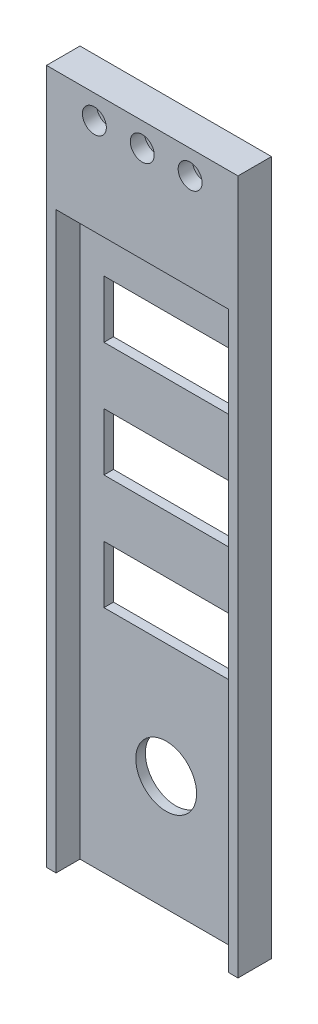
ISO-10303-21;
HEADER;
FILE_DESCRIPTION(('STEP AP214'),'2;1');
FILE_NAME('part.step','',(''),(''),'','','');
FILE_SCHEMA(('AUTOMOTIVE_DESIGN { 1 0 10303 214 1 1 1 1 }'));
ENDSEC;
DATA;
#1=APPLICATION_CONTEXT('core data for automotive mechanical design processes');
#2=APPLICATION_PROTOCOL_DEFINITION('international standard','automotive_design',2000,#1);
#3=PRODUCT_CONTEXT('',#1,'mechanical');
#4=PRODUCT('Part','Part','',(#3));
#5=PRODUCT_RELATED_PRODUCT_CATEGORY('part','',(#4));
#6=PRODUCT_DEFINITION_FORMATION('','',#4);
#7=PRODUCT_DEFINITION_CONTEXT('part definition',#1,'design');
#8=PRODUCT_DEFINITION('design','',#6,#7);
#9=PRODUCT_DEFINITION_SHAPE('','',#8);
#10=(LENGTH_UNIT() NAMED_UNIT(*) SI_UNIT(.MILLI.,.METRE.));
#11=(NAMED_UNIT(*) PLANE_ANGLE_UNIT() SI_UNIT($,.RADIAN.));
#12=(NAMED_UNIT(*) SI_UNIT($,.STERADIAN.) SOLID_ANGLE_UNIT());
#13=UNCERTAINTY_MEASURE_WITH_UNIT(LENGTH_MEASURE(1.E-05),#10,'distance_accuracy_value','');
#14=(GEOMETRIC_REPRESENTATION_CONTEXT(3) GLOBAL_UNCERTAINTY_ASSIGNED_CONTEXT((#13)) GLOBAL_UNIT_ASSIGNED_CONTEXT((#10,
#11,#12)) REPRESENTATION_CONTEXT('',''));
#15=CARTESIAN_POINT('',(0.,0.,0.));
#16=DIRECTION('',(0.,0.,1.));
#17=DIRECTION('',(1.,0.,0.));
#18=AXIS2_PLACEMENT_3D('',#15,#16,#17);
#19=CARTESIAN_POINT('',(20.,140.1,0.));
#20=DIRECTION('',(0.,0.,1.));
#21=DIRECTION('',(1.,0.,0.));
#22=AXIS2_PLACEMENT_3D('',#19,#20,#21);
#23=CYLINDRICAL_SURFACE('',#22,1.25);
#24=CARTESIAN_POINT('',(20.,140.1,0.));
#25=DIRECTION('',(0.,0.,1.));
#26=DIRECTION('',(1.,0.,0.));
#27=AXIS2_PLACEMENT_3D('',#24,#25,#26);
#28=CIRCLE('',#27,1.25);
#29=CARTESIAN_POINT('',(21.25,140.1,0.));
#30=VERTEX_POINT('',#29);
#31=EDGE_CURVE('E329',#30,#30,#28,.T.);
#32=ORIENTED_EDGE('',*,*,#31,.F.);
#33=EDGE_LOOP('',(#32));
#34=FACE_BOUND('',#33,.T.);
#35=CARTESIAN_POINT('',(20.,140.1,4.));
#36=DIRECTION('',(0.,0.,1.));
#37=DIRECTION('',(1.,0.,0.));
#38=AXIS2_PLACEMENT_3D('',#35,#36,#37);
#39=CIRCLE('',#38,1.25);
#40=CARTESIAN_POINT('',(21.25,140.1,4.));
#41=VERTEX_POINT('',#40);
#42=EDGE_CURVE('E333',#41,#41,#39,.F.);
#43=ORIENTED_EDGE('',*,*,#42,.F.);
#44=EDGE_LOOP('',(#43));
#45=FACE_BOUND('',#44,.T.);
#46=ADVANCED_FACE('F34',(#34,#45),#23,.F.);
#47=CARTESIAN_POINT('',(10.,140.1,0.));
#48=DIRECTION('',(0.,0.,1.));
#49=DIRECTION('',(1.,0.,0.));
#50=AXIS2_PLACEMENT_3D('',#47,#48,#49);
#51=CYLINDRICAL_SURFACE('',#50,1.25);
#52=CARTESIAN_POINT('',(10.,140.1,0.));
#53=DIRECTION('',(0.,0.,1.));
#54=DIRECTION('',(1.,0.,0.));
#55=AXIS2_PLACEMENT_3D('',#52,#53,#54);
#56=CIRCLE('',#55,1.25);
#57=CARTESIAN_POINT('',(11.25,140.1,0.));
#58=VERTEX_POINT('',#57);
#59=EDGE_CURVE('E326',#58,#58,#56,.T.);
#60=ORIENTED_EDGE('',*,*,#59,.F.);
#61=EDGE_LOOP('',(#60));
#62=FACE_BOUND('',#61,.T.);
#63=CARTESIAN_POINT('',(10.,140.1,4.));
#64=DIRECTION('',(0.,0.,1.));
#65=DIRECTION('',(1.,0.,0.));
#66=AXIS2_PLACEMENT_3D('',#63,#64,#65);
#67=CIRCLE('',#66,1.25);
#68=CARTESIAN_POINT('',(11.25,140.1,4.));
#69=VERTEX_POINT('',#68);
#70=EDGE_CURVE('E367',#69,#69,#67,.F.);
#71=ORIENTED_EDGE('',*,*,#70,.F.);
#72=EDGE_LOOP('',(#71));
#73=FACE_BOUND('',#72,.T.);
#74=ADVANCED_FACE('F375',(#62,#73),#51,.F.);
#75=CARTESIAN_POINT('',(30.,140.1,0.));
#76=DIRECTION('',(0.,0.,1.));
#77=DIRECTION('',(1.,0.,0.));
#78=AXIS2_PLACEMENT_3D('',#75,#76,#77);
#79=CYLINDRICAL_SURFACE('',#78,1.25);
#80=CARTESIAN_POINT('',(30.,140.1,0.));
#81=DIRECTION('',(0.,0.,1.));
#82=DIRECTION('',(1.,0.,0.));
#83=AXIS2_PLACEMENT_3D('',#80,#81,#82);
#84=CIRCLE('',#83,1.25);
#85=CARTESIAN_POINT('',(31.25,140.1,0.));
#86=VERTEX_POINT('',#85);
#87=EDGE_CURVE('E330',#86,#86,#84,.T.);
#88=ORIENTED_EDGE('',*,*,#87,.F.);
#89=EDGE_LOOP('',(#88));
#90=FACE_BOUND('',#89,.T.);
#91=CARTESIAN_POINT('',(30.,140.1,4.));
#92=DIRECTION('',(0.,0.,1.));
#93=DIRECTION('',(1.,0.,0.));
#94=AXIS2_PLACEMENT_3D('',#91,#92,#93);
#95=CIRCLE('',#94,1.25);
#96=CARTESIAN_POINT('',(31.25,140.1,4.));
#97=VERTEX_POINT('',#96);
#98=EDGE_CURVE('E311',#97,#97,#95,.F.);
#99=ORIENTED_EDGE('',*,*,#98,.F.);
#100=EDGE_LOOP('',(#99));
#101=FACE_BOUND('',#100,.T.);
#102=ADVANCED_FACE('F381',(#90,#101),#79,.F.);
#103=CARTESIAN_POINT('',(0.,0.,7.));
#104=DIRECTION('',(0.,1.,0.));
#105=DIRECTION('',(0.,0.,1.));
#106=AXIS2_PLACEMENT_3D('',#103,#104,#105);
#107=PLANE('',#106);
#108=DIRECTION('',(1.,0.,0.));
#109=VECTOR('',#108,1.);
#110=CARTESIAN_POINT('',(2.,0.,2.));
#111=LINE('',#110,#109);
#112=CARTESIAN_POINT('',(2.,0.,2.));
#113=VERTEX_POINT('',#112);
#114=CARTESIAN_POINT('',(38.,0.,2.));
#115=VERTEX_POINT('',#114);
#116=EDGE_CURVE('E279',#113,#115,#111,.T.);
#117=ORIENTED_EDGE('',*,*,#116,.F.);
#118=DIRECTION('',(0.,0.,1.));
#119=VECTOR('',#118,1.);
#120=CARTESIAN_POINT('',(2.,0.,2.));
#121=LINE('',#120,#119);
#122=CARTESIAN_POINT('',(2.,0.,7.));
#123=VERTEX_POINT('',#122);
#124=EDGE_CURVE('E289',#113,#123,#121,.T.);
#125=ORIENTED_EDGE('',*,*,#124,.T.);
#126=DIRECTION('',(1.,0.,0.));
#127=VECTOR('',#126,1.);
#128=CARTESIAN_POINT('',(0.,0.,7.));
#129=LINE('',#128,#127);
#130=CARTESIAN_POINT('',(0.,0.,7.));
#131=VERTEX_POINT('',#130);
#132=EDGE_CURVE('E337',#131,#123,#129,.T.);
#133=ORIENTED_EDGE('',*,*,#132,.F.);
#134=DIRECTION('',(0.,0.,-1.));
#135=VECTOR('',#134,1.);
#136=CARTESIAN_POINT('',(0.,0.,7.));
#137=LINE('',#136,#135);
#138=CARTESIAN_POINT('',(0.,0.,0.));
#139=VERTEX_POINT('',#138);
#140=EDGE_CURVE('E349',#131,#139,#137,.T.);
#141=ORIENTED_EDGE('',*,*,#140,.T.);
#142=DIRECTION('',(1.,0.,0.));
#143=VECTOR('',#142,1.);
#144=CARTESIAN_POINT('',(0.,0.,0.));
#145=LINE('',#144,#143);
#146=CARTESIAN_POINT('',(40.,0.,0.));
#147=VERTEX_POINT('',#146);
#148=EDGE_CURVE('E336',#139,#147,#145,.T.);
#149=ORIENTED_EDGE('',*,*,#148,.T.);
#150=DIRECTION('',(0.,0.,-1.));
#151=VECTOR('',#150,1.);
#152=CARTESIAN_POINT('',(40.,0.,7.));
#153=LINE('',#152,#151);
#154=CARTESIAN_POINT('',(40.,0.,7.));
#155=VERTEX_POINT('',#154);
#156=EDGE_CURVE('E11',#155,#147,#153,.T.);
#157=ORIENTED_EDGE('',*,*,#156,.F.);
#158=CARTESIAN_POINT('',(38.,0.,7.));
#159=VERTEX_POINT('',#158);
#160=EDGE_CURVE('E341',#159,#155,#129,.T.);
#161=ORIENTED_EDGE('',*,*,#160,.F.);
#162=DIRECTION('',(0.,0.,1.));
#163=VECTOR('',#162,1.);
#164=CARTESIAN_POINT('',(38.,0.,2.));
#165=LINE('',#164,#163);
#166=EDGE_CURVE('E300',#115,#159,#165,.T.);
#167=ORIENTED_EDGE('',*,*,#166,.F.);
#168=EDGE_LOOP('',(#117,#125,#133,#141,#149,#157,#161,#167));
#169=FACE_BOUND('',#168,.T.);
#170=ADVANCED_FACE('F36',(#169),#107,.F.);
#171=CARTESIAN_POINT('',(40.,0.,7.));
#172=DIRECTION('',(-1.,0.,0.));
#173=DIRECTION('',(0.,0.,1.));
#174=AXIS2_PLACEMENT_3D('',#171,#172,#173);
#175=PLANE('',#174);
#176=DIRECTION('',(0.,1.,0.));
#177=VECTOR('',#176,1.);
#178=CARTESIAN_POINT('',(40.,0.,0.));
#179=LINE('',#178,#177);
#180=CARTESIAN_POINT('',(40.,145.1,0.));
#181=VERTEX_POINT('',#180);
#182=EDGE_CURVE('E352',#147,#181,#179,.T.);
#183=ORIENTED_EDGE('',*,*,#182,.T.);
#184=DIRECTION('',(0.,0.,-1.));
#185=VECTOR('',#184,1.);
#186=CARTESIAN_POINT('',(40.,145.1,7.));
#187=LINE('',#186,#185);
#188=CARTESIAN_POINT('',(40.,145.1,7.));
#189=VERTEX_POINT('',#188);
#190=EDGE_CURVE('E43',#189,#181,#187,.T.);
#191=ORIENTED_EDGE('',*,*,#190,.F.);
#192=DIRECTION('',(0.,1.,0.));
#193=VECTOR('',#192,1.);
#194=CARTESIAN_POINT('',(40.,0.,7.));
#195=LINE('',#194,#193);
#196=EDGE_CURVE('E340',#155,#189,#195,.T.);
#197=ORIENTED_EDGE('',*,*,#196,.F.);
#198=ORIENTED_EDGE('',*,*,#156,.T.);
#199=EDGE_LOOP('',(#183,#191,#197,#198));
#200=FACE_BOUND('',#199,.T.);
#201=ADVANCED_FACE('F400',(#200),#175,.F.);
#202=CARTESIAN_POINT('',(0.,145.1,7.));
#203=DIRECTION('',(0.,1.,0.));
#204=DIRECTION('',(0.,0.,1.));
#205=AXIS2_PLACEMENT_3D('',#202,#203,#204);
#206=PLANE('',#205);
#207=DIRECTION('',(1.,0.,0.));
#208=VECTOR('',#207,1.);
#209=CARTESIAN_POINT('',(0.,145.1,0.));
#210=LINE('',#209,#208);
#211=CARTESIAN_POINT('',(0.,145.1,0.));
#212=VERTEX_POINT('',#211);
#213=EDGE_CURVE('E355',#212,#181,#210,.T.);
#214=ORIENTED_EDGE('',*,*,#213,.F.);
#215=DIRECTION('',(0.,0.,-1.));
#216=VECTOR('',#215,1.);
#217=CARTESIAN_POINT('',(0.,145.1,7.));
#218=LINE('',#217,#216);
#219=CARTESIAN_POINT('',(0.,145.1,7.));
#220=VERTEX_POINT('',#219);
#221=EDGE_CURVE('E362',#220,#212,#218,.T.);
#222=ORIENTED_EDGE('',*,*,#221,.F.);
#223=DIRECTION('',(1.,0.,0.));
#224=VECTOR('',#223,1.);
#225=CARTESIAN_POINT('',(0.,145.1,7.));
#226=LINE('',#225,#224);
#227=EDGE_CURVE('E343',#220,#189,#226,.T.);
#228=ORIENTED_EDGE('',*,*,#227,.T.);
#229=ORIENTED_EDGE('',*,*,#190,.T.);
#230=EDGE_LOOP('',(#214,#222,#228,#229));
#231=FACE_BOUND('',#230,.T.);
#232=ADVANCED_FACE('F397',(#231),#206,.T.);
#233=CARTESIAN_POINT('',(0.,0.,7.));
#234=DIRECTION('',(-1.,0.,0.));
#235=DIRECTION('',(0.,0.,1.));
#236=AXIS2_PLACEMENT_3D('',#233,#234,#235);
#237=PLANE('',#236);
#238=DIRECTION('',(0.,1.,0.));
#239=VECTOR('',#238,1.);
#240=CARTESIAN_POINT('',(0.,0.,0.));
#241=LINE('',#240,#239);
#242=EDGE_CURVE('E358',#139,#212,#241,.T.);
#243=ORIENTED_EDGE('',*,*,#242,.F.);
#244=ORIENTED_EDGE('',*,*,#140,.F.);
#245=DIRECTION('',(0.,1.,0.));
#246=VECTOR('',#245,1.);
#247=CARTESIAN_POINT('',(0.,0.,7.));
#248=LINE('',#247,#246);
#249=EDGE_CURVE('E346',#131,#220,#248,.T.);
#250=ORIENTED_EDGE('',*,*,#249,.T.);
#251=ORIENTED_EDGE('',*,*,#221,.T.);
#252=EDGE_LOOP('',(#243,#244,#250,#251));
#253=FACE_BOUND('',#252,.T.);
#254=ADVANCED_FACE('F390',(#253),#237,.T.);
#255=CARTESIAN_POINT('',(0.,0.,7.));
#256=DIRECTION('',(0.,0.,1.));
#257=DIRECTION('',(1.,0.,0.));
#258=AXIS2_PLACEMENT_3D('',#255,#256,#257);
#259=PLANE('',#258);
#260=DIRECTION('',(0.,-1.,0.));
#261=VECTOR('',#260,1.);
#262=CARTESIAN_POINT('',(2.,0.,7.));
#263=LINE('',#262,#261);
#264=CARTESIAN_POINT('',(2.,120.,7.));
#265=VERTEX_POINT('',#264);
#266=EDGE_CURVE('E211',#265,#123,#263,.T.);
#267=ORIENTED_EDGE('',*,*,#266,.F.);
#268=DIRECTION('',(-1.,0.,0.));
#269=VECTOR('',#268,1.);
#270=CARTESIAN_POINT('',(2.,120.,7.));
#271=LINE('',#270,#269);
#272=CARTESIAN_POINT('',(38.,120.,7.));
#273=VERTEX_POINT('',#272);
#274=EDGE_CURVE('E280',#273,#265,#271,.T.);
#275=ORIENTED_EDGE('',*,*,#274,.F.);
#276=DIRECTION('',(0.,1.,0.));
#277=VECTOR('',#276,1.);
#278=CARTESIAN_POINT('',(38.,0.,7.));
#279=LINE('',#278,#277);
#280=EDGE_CURVE('E291',#159,#273,#279,.T.);
#281=ORIENTED_EDGE('',*,*,#280,.F.);
#282=ORIENTED_EDGE('',*,*,#160,.T.);
#283=ORIENTED_EDGE('',*,*,#196,.T.);
#284=ORIENTED_EDGE('',*,*,#227,.F.);
#285=ORIENTED_EDGE('',*,*,#249,.F.);
#286=ORIENTED_EDGE('',*,*,#132,.T.);
#287=EDGE_LOOP('',(#267,#275,#281,#282,#283,#284,#285,#286));
#288=FACE_BOUND('',#287,.T.);
#289=CARTESIAN_POINT('',(10.,140.1,7.));
#290=DIRECTION('',(0.,0.,1.));
#291=DIRECTION('',(1.,0.,0.));
#292=AXIS2_PLACEMENT_3D('',#289,#290,#291);
#293=CIRCLE('',#292,2.5);
#294=CARTESIAN_POINT('',(12.5,140.1,7.));
#295=VERTEX_POINT('',#294);
#296=EDGE_CURVE('E312',#295,#295,#293,.T.);
#297=ORIENTED_EDGE('',*,*,#296,.F.);
#298=EDGE_LOOP('',(#297));
#299=FACE_BOUND('',#298,.T.);
#300=CARTESIAN_POINT('',(20.,140.1,7.));
#301=DIRECTION('',(0.,0.,1.));
#302=DIRECTION('',(1.,0.,0.));
#303=AXIS2_PLACEMENT_3D('',#300,#301,#302);
#304=CIRCLE('',#303,2.5);
#305=CARTESIAN_POINT('',(22.5,140.1,7.));
#306=VERTEX_POINT('',#305);
#307=EDGE_CURVE('E318',#306,#306,#304,.T.);
#308=ORIENTED_EDGE('',*,*,#307,.F.);
#309=EDGE_LOOP('',(#308));
#310=FACE_BOUND('',#309,.T.);
#311=CARTESIAN_POINT('',(30.,140.1,7.));
#312=DIRECTION('',(0.,0.,1.));
#313=DIRECTION('',(1.,0.,0.));
#314=AXIS2_PLACEMENT_3D('',#311,#312,#313);
#315=CIRCLE('',#314,2.5);
#316=CARTESIAN_POINT('',(32.5,140.1,7.));
#317=VERTEX_POINT('',#316);
#318=EDGE_CURVE('E307',#317,#317,#315,.T.);
#319=ORIENTED_EDGE('',*,*,#318,.F.);
#320=EDGE_LOOP('',(#319));
#321=FACE_BOUND('',#320,.T.);
#322=ADVANCED_FACE('F387',(#288,#299,#310,#321),#259,.T.);
#323=CARTESIAN_POINT('',(0.,0.,0.));
#324=DIRECTION('',(0.,0.,1.));
#325=DIRECTION('',(1.,0.,0.));
#326=AXIS2_PLACEMENT_3D('',#323,#324,#325);
#327=PLANE('',#326);
#328=DIRECTION('',(-1.,0.,0.));
#329=VECTOR('',#328,1.);
#330=CARTESIAN_POINT('',(7.,108.,0.));
#331=LINE('',#330,#329);
#332=CARTESIAN_POINT('',(33.,108.,0.));
#333=VERTEX_POINT('',#332);
#334=CARTESIAN_POINT('',(7.,108.,0.));
#335=VERTEX_POINT('',#334);
#336=EDGE_CURVE('E185',#333,#335,#331,.T.);
#337=ORIENTED_EDGE('',*,*,#336,.T.);
#338=DIRECTION('',(0.,-1.,0.));
#339=VECTOR('',#338,1.);
#340=CARTESIAN_POINT('',(7.,108.,0.));
#341=LINE('',#340,#339);
#342=CARTESIAN_POINT('',(7.,96.,0.));
#343=VERTEX_POINT('',#342);
#344=EDGE_CURVE('E177',#335,#343,#341,.T.);
#345=ORIENTED_EDGE('',*,*,#344,.T.);
#346=DIRECTION('',(1.,0.,0.));
#347=VECTOR('',#346,1.);
#348=CARTESIAN_POINT('',(7.,96.,0.));
#349=LINE('',#348,#347);
#350=CARTESIAN_POINT('',(33.,96.,0.));
#351=VERTEX_POINT('',#350);
#352=EDGE_CURVE('E188',#343,#351,#349,.T.);
#353=ORIENTED_EDGE('',*,*,#352,.T.);
#354=DIRECTION('',(0.,1.,0.));
#355=VECTOR('',#354,1.);
#356=CARTESIAN_POINT('',(33.,108.,0.));
#357=LINE('',#356,#355);
#358=EDGE_CURVE('E51',#351,#333,#357,.T.);
#359=ORIENTED_EDGE('',*,*,#358,.T.);
#360=EDGE_LOOP('',(#337,#345,#353,#359));
#361=FACE_BOUND('',#360,.T.);
#362=DIRECTION('',(-1.,0.,0.));
#363=VECTOR('',#362,1.);
#364=CARTESIAN_POINT('',(7.,84.,0.));
#365=LINE('',#364,#363);
#366=CARTESIAN_POINT('',(33.,84.,0.));
#367=VERTEX_POINT('',#366);
#368=CARTESIAN_POINT('',(7.,84.,0.));
#369=VERTEX_POINT('',#368);
#370=EDGE_CURVE('E223',#367,#369,#365,.T.);
#371=ORIENTED_EDGE('',*,*,#370,.T.);
#372=DIRECTION('',(0.,-1.,0.));
#373=VECTOR('',#372,1.);
#374=CARTESIAN_POINT('',(7.,84.,0.));
#375=LINE('',#374,#373);
#376=CARTESIAN_POINT('',(7.,72.,0.));
#377=VERTEX_POINT('',#376);
#378=EDGE_CURVE('E215',#369,#377,#375,.T.);
#379=ORIENTED_EDGE('',*,*,#378,.T.);
#380=DIRECTION('',(1.,0.,0.));
#381=VECTOR('',#380,1.);
#382=CARTESIAN_POINT('',(7.,72.,0.));
#383=LINE('',#382,#381);
#384=CARTESIAN_POINT('',(33.,72.,0.));
#385=VERTEX_POINT('',#384);
#386=EDGE_CURVE('E218',#377,#385,#383,.T.);
#387=ORIENTED_EDGE('',*,*,#386,.T.);
#388=DIRECTION('',(0.,1.,0.));
#389=VECTOR('',#388,1.);
#390=CARTESIAN_POINT('',(33.,84.,0.));
#391=LINE('',#390,#389);
#392=EDGE_CURVE('E59',#385,#367,#391,.T.);
#393=ORIENTED_EDGE('',*,*,#392,.T.);
#394=EDGE_LOOP('',(#371,#379,#387,#393));
#395=FACE_BOUND('',#394,.T.);
#396=DIRECTION('',(-1.,0.,0.));
#397=VECTOR('',#396,1.);
#398=CARTESIAN_POINT('',(7.00000000000001,60.,0.));
#399=LINE('',#398,#397);
#400=CARTESIAN_POINT('',(33.,60.,0.));
#401=VERTEX_POINT('',#400);
#402=CARTESIAN_POINT('',(7.00000000000001,60.,0.));
#403=VERTEX_POINT('',#402);
#404=EDGE_CURVE('E255',#401,#403,#399,.T.);
#405=ORIENTED_EDGE('',*,*,#404,.T.);
#406=DIRECTION('',(0.,-1.,0.));
#407=VECTOR('',#406,1.);
#408=CARTESIAN_POINT('',(7.00000000000001,60.,0.));
#409=LINE('',#408,#407);
#410=CARTESIAN_POINT('',(7.00000000000001,48.,0.));
#411=VERTEX_POINT('',#410);
#412=EDGE_CURVE('E245',#403,#411,#409,.T.);
#413=ORIENTED_EDGE('',*,*,#412,.T.);
#414=DIRECTION('',(1.,0.,0.));
#415=VECTOR('',#414,1.);
#416=CARTESIAN_POINT('',(7.00000000000001,48.,0.));
#417=LINE('',#416,#415);
#418=CARTESIAN_POINT('',(33.,48.,0.));
#419=VERTEX_POINT('',#418);
#420=EDGE_CURVE('E248',#411,#419,#417,.T.);
#421=ORIENTED_EDGE('',*,*,#420,.T.);
#422=DIRECTION('',(0.,1.,0.));
#423=VECTOR('',#422,1.);
#424=CARTESIAN_POINT('',(33.,60.,0.));
#425=LINE('',#424,#423);
#426=EDGE_CURVE('E252',#419,#401,#425,.T.);
#427=ORIENTED_EDGE('',*,*,#426,.T.);
#428=EDGE_LOOP('',(#405,#413,#421,#427));
#429=FACE_BOUND('',#428,.T.);
#430=CARTESIAN_POINT('',(20.,24.,0.));
#431=DIRECTION('',(0.,0.,1.));
#432=DIRECTION('',(1.,0.,0.));
#433=AXIS2_PLACEMENT_3D('',#430,#431,#432);
#434=CIRCLE('',#433,6.35);
#435=CARTESIAN_POINT('',(26.35,24.,0.));
#436=VERTEX_POINT('',#435);
#437=EDGE_CURVE('E304',#436,#436,#434,.T.);
#438=ORIENTED_EDGE('',*,*,#437,.T.);
#439=EDGE_LOOP('',(#438));
#440=FACE_BOUND('',#439,.T.);
#441=ORIENTED_EDGE('',*,*,#87,.T.);
#442=EDGE_LOOP('',(#441));
#443=FACE_BOUND('',#442,.T.);
#444=ORIENTED_EDGE('',*,*,#59,.T.);
#445=EDGE_LOOP('',(#444));
#446=FACE_BOUND('',#445,.T.);
#447=ORIENTED_EDGE('',*,*,#31,.T.);
#448=EDGE_LOOP('',(#447));
#449=FACE_BOUND('',#448,.T.);
#450=ORIENTED_EDGE('',*,*,#148,.F.);
#451=ORIENTED_EDGE('',*,*,#242,.T.);
#452=ORIENTED_EDGE('',*,*,#213,.T.);
#453=ORIENTED_EDGE('',*,*,#182,.F.);
#454=EDGE_LOOP('',(#450,#451,#452,#453));
#455=FACE_BOUND('',#454,.T.);
#456=ADVANCED_FACE('F192',(#361,#395,#429,#440,#443,#446,#449,#455),#327,.F.);
#457=CARTESIAN_POINT('',(30.,140.1,4.));
#458=DIRECTION('',(0.,0.,1.));
#459=DIRECTION('',(1.,0.,0.));
#460=AXIS2_PLACEMENT_3D('',#457,#458,#459);
#461=PLANE('',#460);
#462=CARTESIAN_POINT('',(30.,140.1,4.));
#463=DIRECTION('',(0.,0.,1.));
#464=DIRECTION('',(1.,0.,0.));
#465=AXIS2_PLACEMENT_3D('',#462,#463,#464);
#466=CIRCLE('',#465,2.5);
#467=CARTESIAN_POINT('',(32.5,140.1,4.));
#468=VERTEX_POINT('',#467);
#469=EDGE_CURVE('E321',#468,#468,#466,.T.);
#470=ORIENTED_EDGE('',*,*,#469,.T.);
#471=EDGE_LOOP('',(#470));
#472=FACE_BOUND('',#471,.T.);
#473=ORIENTED_EDGE('',*,*,#98,.T.);
#474=EDGE_LOOP('',(#473));
#475=FACE_BOUND('',#474,.T.);
#476=ADVANCED_FACE('F394',(#472,#475),#461,.T.);
#477=CARTESIAN_POINT('',(30.,140.1,4.));
#478=DIRECTION('',(0.,0.,1.));
#479=DIRECTION('',(1.,0.,0.));
#480=AXIS2_PLACEMENT_3D('',#477,#478,#479);
#481=CYLINDRICAL_SURFACE('',#480,2.5);
#482=ORIENTED_EDGE('',*,*,#469,.F.);
#483=EDGE_LOOP('',(#482));
#484=FACE_BOUND('',#483,.T.);
#485=ORIENTED_EDGE('',*,*,#318,.T.);
#486=EDGE_LOOP('',(#485));
#487=FACE_BOUND('',#486,.T.);
#488=ADVANCED_FACE('F460',(#484,#487),#481,.F.);
#489=CARTESIAN_POINT('',(10.,140.1,4.));
#490=DIRECTION('',(0.,0.,1.));
#491=DIRECTION('',(1.,0.,0.));
#492=AXIS2_PLACEMENT_3D('',#489,#490,#491);
#493=PLANE('',#492);
#494=CARTESIAN_POINT('',(10.,140.1,4.));
#495=DIRECTION('',(0.,0.,1.));
#496=DIRECTION('',(1.,0.,0.));
#497=AXIS2_PLACEMENT_3D('',#494,#495,#496);
#498=CIRCLE('',#497,2.5);
#499=CARTESIAN_POINT('',(12.5,140.1,4.));
#500=VERTEX_POINT('',#499);
#501=EDGE_CURVE('E308',#500,#500,#498,.T.);
#502=ORIENTED_EDGE('',*,*,#501,.T.);
#503=EDGE_LOOP('',(#502));
#504=FACE_BOUND('',#503,.T.);
#505=ORIENTED_EDGE('',*,*,#70,.T.);
#506=EDGE_LOOP('',(#505));
#507=FACE_BOUND('',#506,.T.);
#508=ADVANCED_FACE('F457',(#504,#507),#493,.T.);
#509=CARTESIAN_POINT('',(10.,140.1,4.));
#510=DIRECTION('',(0.,0.,1.));
#511=DIRECTION('',(1.,0.,0.));
#512=AXIS2_PLACEMENT_3D('',#509,#510,#511);
#513=CYLINDRICAL_SURFACE('',#512,2.5);
#514=ORIENTED_EDGE('',*,*,#501,.F.);
#515=EDGE_LOOP('',(#514));
#516=FACE_BOUND('',#515,.T.);
#517=ORIENTED_EDGE('',*,*,#296,.T.);
#518=EDGE_LOOP('',(#517));
#519=FACE_BOUND('',#518,.T.);
#520=ADVANCED_FACE('F459',(#516,#519),#513,.F.);
#521=CARTESIAN_POINT('',(20.,140.1,4.));
#522=DIRECTION('',(0.,0.,1.));
#523=DIRECTION('',(1.,0.,0.));
#524=AXIS2_PLACEMENT_3D('',#521,#522,#523);
#525=PLANE('',#524);
#526=CARTESIAN_POINT('',(20.,140.1,4.));
#527=DIRECTION('',(0.,0.,1.));
#528=DIRECTION('',(1.,0.,0.));
#529=AXIS2_PLACEMENT_3D('',#526,#527,#528);
#530=CIRCLE('',#529,2.5);
#531=CARTESIAN_POINT('',(22.5,140.1,4.));
#532=VERTEX_POINT('',#531);
#533=EDGE_CURVE('E315',#532,#532,#530,.T.);
#534=ORIENTED_EDGE('',*,*,#533,.T.);
#535=EDGE_LOOP('',(#534));
#536=FACE_BOUND('',#535,.T.);
#537=ORIENTED_EDGE('',*,*,#42,.T.);
#538=EDGE_LOOP('',(#537));
#539=FACE_BOUND('',#538,.T.);
#540=ADVANCED_FACE('F372',(#536,#539),#525,.T.);
#541=CARTESIAN_POINT('',(20.,140.1,4.));
#542=DIRECTION('',(0.,0.,1.));
#543=DIRECTION('',(1.,0.,0.));
#544=AXIS2_PLACEMENT_3D('',#541,#542,#543);
#545=CYLINDRICAL_SURFACE('',#544,2.5);
#546=ORIENTED_EDGE('',*,*,#533,.F.);
#547=EDGE_LOOP('',(#546));
#548=FACE_BOUND('',#547,.T.);
#549=ORIENTED_EDGE('',*,*,#307,.T.);
#550=EDGE_LOOP('',(#549));
#551=FACE_BOUND('',#550,.T.);
#552=ADVANCED_FACE('F445',(#548,#551),#545,.F.);
#553=CARTESIAN_POINT('',(20.,24.,0.));
#554=DIRECTION('',(0.,0.,1.));
#555=DIRECTION('',(1.,0.,0.));
#556=AXIS2_PLACEMENT_3D('',#553,#554,#555);
#557=CYLINDRICAL_SURFACE('',#556,6.35);
#558=CARTESIAN_POINT('',(20.,24.,2.));
#559=DIRECTION('',(0.,0.,-1.));
#560=DIRECTION('',(-1.,0.,0.));
#561=AXIS2_PLACEMENT_3D('',#558,#559,#560);
#562=CIRCLE('',#561,6.35);
#563=CARTESIAN_POINT('',(13.65,24.,2.));
#564=VERTEX_POINT('',#563);
#565=EDGE_CURVE('E38',#564,#564,#562,.F.);
#566=ORIENTED_EDGE('',*,*,#565,.T.);
#567=EDGE_LOOP('',(#566));
#568=FACE_BOUND('',#567,.T.);
#569=ORIENTED_EDGE('',*,*,#437,.F.);
#570=EDGE_LOOP('',(#569));
#571=FACE_BOUND('',#570,.T.);
#572=ADVANCED_FACE('F437',(#568,#571),#557,.F.);
#573=CARTESIAN_POINT('',(0.,0.,2.));
#574=DIRECTION('',(0.,0.,-1.));
#575=DIRECTION('',(-1.,0.,0.));
#576=AXIS2_PLACEMENT_3D('',#573,#574,#575);
#577=PLANE('',#576);
#578=DIRECTION('',(1.,0.,0.));
#579=VECTOR('',#578,1.);
#580=CARTESIAN_POINT('',(7.,96.,2.));
#581=LINE('',#580,#579);
#582=CARTESIAN_POINT('',(7.,96.,2.));
#583=VERTEX_POINT('',#582);
#584=CARTESIAN_POINT('',(33.,96.,2.));
#585=VERTEX_POINT('',#584);
#586=EDGE_CURVE('E204',#583,#585,#581,.T.);
#587=ORIENTED_EDGE('',*,*,#586,.F.);
#588=DIRECTION('',(0.,-1.,0.));
#589=VECTOR('',#588,1.);
#590=CARTESIAN_POINT('',(7.,108.,2.));
#591=LINE('',#590,#589);
#592=CARTESIAN_POINT('',(7.,108.,2.));
#593=VERTEX_POINT('',#592);
#594=EDGE_CURVE('E180',#593,#583,#591,.T.);
#595=ORIENTED_EDGE('',*,*,#594,.F.);
#596=DIRECTION('',(-1.,0.,0.));
#597=VECTOR('',#596,1.);
#598=CARTESIAN_POINT('',(7.,108.,2.));
#599=LINE('',#598,#597);
#600=CARTESIAN_POINT('',(33.,108.,2.));
#601=VERTEX_POINT('',#600);
#602=EDGE_CURVE('E195',#601,#593,#599,.T.);
#603=ORIENTED_EDGE('',*,*,#602,.F.);
#604=DIRECTION('',(0.,1.,0.));
#605=VECTOR('',#604,1.);
#606=CARTESIAN_POINT('',(33.,108.,2.));
#607=LINE('',#606,#605);
#608=EDGE_CURVE('E198',#585,#601,#607,.T.);
#609=ORIENTED_EDGE('',*,*,#608,.F.);
#610=EDGE_LOOP('',(#587,#595,#603,#609));
#611=FACE_BOUND('',#610,.T.);
#612=DIRECTION('',(1.,0.,0.));
#613=VECTOR('',#612,1.);
#614=CARTESIAN_POINT('',(7.,72.,2.));
#615=LINE('',#614,#613);
#616=CARTESIAN_POINT('',(7.,72.,2.));
#617=VERTEX_POINT('',#616);
#618=CARTESIAN_POINT('',(33.,72.,2.));
#619=VERTEX_POINT('',#618);
#620=EDGE_CURVE('E229',#617,#619,#615,.T.);
#621=ORIENTED_EDGE('',*,*,#620,.F.);
#622=DIRECTION('',(0.,-1.,0.));
#623=VECTOR('',#622,1.);
#624=CARTESIAN_POINT('',(7.,84.,2.));
#625=LINE('',#624,#623);
#626=CARTESIAN_POINT('',(7.,84.,2.));
#627=VERTEX_POINT('',#626);
#628=EDGE_CURVE('E227',#627,#617,#625,.T.);
#629=ORIENTED_EDGE('',*,*,#628,.F.);
#630=DIRECTION('',(-1.,0.,0.));
#631=VECTOR('',#630,1.);
#632=CARTESIAN_POINT('',(7.,84.,2.));
#633=LINE('',#632,#631);
#634=CARTESIAN_POINT('',(33.,84.,2.));
#635=VERTEX_POINT('',#634);
#636=EDGE_CURVE('E219',#635,#627,#633,.T.);
#637=ORIENTED_EDGE('',*,*,#636,.F.);
#638=DIRECTION('',(0.,1.,0.));
#639=VECTOR('',#638,1.);
#640=CARTESIAN_POINT('',(33.,84.,2.));
#641=LINE('',#640,#639);
#642=EDGE_CURVE('E233',#619,#635,#641,.T.);
#643=ORIENTED_EDGE('',*,*,#642,.F.);
#644=EDGE_LOOP('',(#621,#629,#637,#643));
#645=FACE_BOUND('',#644,.T.);
#646=DIRECTION('',(1.,0.,0.));
#647=VECTOR('',#646,1.);
#648=CARTESIAN_POINT('',(7.00000000000001,48.,2.));
#649=LINE('',#648,#647);
#650=CARTESIAN_POINT('',(7.00000000000001,48.,2.));
#651=VERTEX_POINT('',#650);
#652=CARTESIAN_POINT('',(33.,48.,2.));
#653=VERTEX_POINT('',#652);
#654=EDGE_CURVE('E261',#651,#653,#649,.T.);
#655=ORIENTED_EDGE('',*,*,#654,.F.);
#656=DIRECTION('',(0.,-1.,0.));
#657=VECTOR('',#656,1.);
#658=CARTESIAN_POINT('',(7.00000000000001,60.,2.));
#659=LINE('',#658,#657);
#660=CARTESIAN_POINT('',(7.00000000000001,60.,2.));
#661=VERTEX_POINT('',#660);
#662=EDGE_CURVE('E259',#661,#651,#659,.T.);
#663=ORIENTED_EDGE('',*,*,#662,.F.);
#664=DIRECTION('',(-1.,0.,0.));
#665=VECTOR('',#664,1.);
#666=CARTESIAN_POINT('',(7.00000000000001,60.,2.));
#667=LINE('',#666,#665);
#668=CARTESIAN_POINT('',(33.,60.,2.));
#669=VERTEX_POINT('',#668);
#670=EDGE_CURVE('E249',#669,#661,#667,.T.);
#671=ORIENTED_EDGE('',*,*,#670,.F.);
#672=DIRECTION('',(0.,1.,0.));
#673=VECTOR('',#672,1.);
#674=CARTESIAN_POINT('',(33.,60.,2.));
#675=LINE('',#674,#673);
#676=EDGE_CURVE('E264',#653,#669,#675,.T.);
#677=ORIENTED_EDGE('',*,*,#676,.F.);
#678=EDGE_LOOP('',(#655,#663,#671,#677));
#679=FACE_BOUND('',#678,.T.);
#680=DIRECTION('',(0.,-1.,0.));
#681=VECTOR('',#680,1.);
#682=CARTESIAN_POINT('',(2.,0.,2.));
#683=LINE('',#682,#681);
#684=CARTESIAN_POINT('',(2.,120.,2.));
#685=VERTEX_POINT('',#684);
#686=EDGE_CURVE('E276',#685,#113,#683,.T.);
#687=ORIENTED_EDGE('',*,*,#686,.T.);
#688=ORIENTED_EDGE('',*,*,#116,.T.);
#689=DIRECTION('',(0.,1.,0.));
#690=VECTOR('',#689,1.);
#691=CARTESIAN_POINT('',(38.,0.,2.));
#692=LINE('',#691,#690);
#693=CARTESIAN_POINT('',(38.,120.,2.));
#694=VERTEX_POINT('',#693);
#695=EDGE_CURVE('E283',#115,#694,#692,.T.);
#696=ORIENTED_EDGE('',*,*,#695,.T.);
#697=DIRECTION('',(-1.,0.,0.));
#698=VECTOR('',#697,1.);
#699=CARTESIAN_POINT('',(2.,120.,2.));
#700=LINE('',#699,#698);
#701=EDGE_CURVE('E286',#694,#685,#700,.T.);
#702=ORIENTED_EDGE('',*,*,#701,.T.);
#703=EDGE_LOOP('',(#687,#688,#696,#702));
#704=FACE_BOUND('',#703,.T.);
#705=ORIENTED_EDGE('',*,*,#565,.F.);
#706=EDGE_LOOP('',(#705));
#707=FACE_BOUND('',#706,.T.);
#708=ADVANCED_FACE('F434',(#611,#645,#679,#704,#707),#577,.F.);
#709=CARTESIAN_POINT('',(2.,0.,2.));
#710=DIRECTION('',(-1.,0.,0.));
#711=DIRECTION('',(0.,0.,1.));
#712=AXIS2_PLACEMENT_3D('',#709,#710,#711);
#713=PLANE('',#712);
#714=ORIENTED_EDGE('',*,*,#266,.T.);
#715=ORIENTED_EDGE('',*,*,#124,.F.);
#716=ORIENTED_EDGE('',*,*,#686,.F.);
#717=DIRECTION('',(0.,0.,1.));
#718=VECTOR('',#717,1.);
#719=CARTESIAN_POINT('',(2.,120.,2.));
#720=LINE('',#719,#718);
#721=EDGE_CURVE('E296',#685,#265,#720,.T.);
#722=ORIENTED_EDGE('',*,*,#721,.T.);
#723=EDGE_LOOP('',(#714,#715,#716,#722));
#724=FACE_BOUND('',#723,.T.);
#725=ADVANCED_FACE('F424',(#724),#713,.F.);
#726=CARTESIAN_POINT('',(2.,120.,2.));
#727=DIRECTION('',(0.,1.,0.));
#728=DIRECTION('',(0.,0.,1.));
#729=AXIS2_PLACEMENT_3D('',#726,#727,#728);
#730=PLANE('',#729);
#731=ORIENTED_EDGE('',*,*,#274,.T.);
#732=ORIENTED_EDGE('',*,*,#721,.F.);
#733=ORIENTED_EDGE('',*,*,#701,.F.);
#734=DIRECTION('',(0.,0.,1.));
#735=VECTOR('',#734,1.);
#736=CARTESIAN_POINT('',(38.,120.,2.));
#737=LINE('',#736,#735);
#738=EDGE_CURVE('E298',#694,#273,#737,.T.);
#739=ORIENTED_EDGE('',*,*,#738,.T.);
#740=EDGE_LOOP('',(#731,#732,#733,#739));
#741=FACE_BOUND('',#740,.T.);
#742=ADVANCED_FACE('F428',(#741),#730,.F.);
#743=CARTESIAN_POINT('',(38.,0.,2.));
#744=DIRECTION('',(1.,0.,0.));
#745=DIRECTION('',(0.,0.,-1.));
#746=AXIS2_PLACEMENT_3D('',#743,#744,#745);
#747=PLANE('',#746);
#748=ORIENTED_EDGE('',*,*,#280,.T.);
#749=ORIENTED_EDGE('',*,*,#738,.F.);
#750=ORIENTED_EDGE('',*,*,#695,.F.);
#751=ORIENTED_EDGE('',*,*,#166,.T.);
#752=EDGE_LOOP('',(#748,#749,#750,#751));
#753=FACE_BOUND('',#752,.T.);
#754=ADVANCED_FACE('F430',(#753),#747,.F.);
#755=CARTESIAN_POINT('',(7.00000000000001,60.,0.));
#756=DIRECTION('',(-1.,0.,0.));
#757=DIRECTION('',(0.,-1.,0.));
#758=AXIS2_PLACEMENT_3D('',#755,#756,#757);
#759=PLANE('',#758);
#760=ORIENTED_EDGE('',*,*,#662,.T.);
#761=DIRECTION('',(0.,0.,1.));
#762=VECTOR('',#761,1.);
#763=CARTESIAN_POINT('',(7.00000000000001,48.,0.));
#764=LINE('',#763,#762);
#765=EDGE_CURVE('E258',#411,#651,#764,.T.);
#766=ORIENTED_EDGE('',*,*,#765,.F.);
#767=ORIENTED_EDGE('',*,*,#412,.F.);
#768=DIRECTION('',(0.,0.,1.));
#769=VECTOR('',#768,1.);
#770=CARTESIAN_POINT('',(7.00000000000001,60.,0.));
#771=LINE('',#770,#769);
#772=EDGE_CURVE('E230',#403,#661,#771,.T.);
#773=ORIENTED_EDGE('',*,*,#772,.T.);
#774=EDGE_LOOP('',(#760,#766,#767,#773));
#775=FACE_BOUND('',#774,.T.);
#776=ADVANCED_FACE('F541',(#775),#759,.F.);
#777=CARTESIAN_POINT('',(7.00000000000001,60.,0.));
#778=DIRECTION('',(0.,1.,0.));
#779=DIRECTION('',(0.,0.,1.));
#780=AXIS2_PLACEMENT_3D('',#777,#778,#779);
#781=PLANE('',#780);
#782=ORIENTED_EDGE('',*,*,#670,.T.);
#783=ORIENTED_EDGE('',*,*,#772,.F.);
#784=ORIENTED_EDGE('',*,*,#404,.F.);
#785=DIRECTION('',(0.,0.,1.));
#786=VECTOR('',#785,1.);
#787=CARTESIAN_POINT('',(33.,60.,0.));
#788=LINE('',#787,#786);
#789=EDGE_CURVE('E270',#401,#669,#788,.T.);
#790=ORIENTED_EDGE('',*,*,#789,.T.);
#791=EDGE_LOOP('',(#782,#783,#784,#790));
#792=FACE_BOUND('',#791,.T.);
#793=ADVANCED_FACE('F560',(#792),#781,.F.);
#794=CARTESIAN_POINT('',(33.,60.,0.));
#795=DIRECTION('',(1.,0.,0.));
#796=DIRECTION('',(0.,0.,-1.));
#797=AXIS2_PLACEMENT_3D('',#794,#795,#796);
#798=PLANE('',#797);
#799=ORIENTED_EDGE('',*,*,#676,.T.);
#800=ORIENTED_EDGE('',*,*,#789,.F.);
#801=ORIENTED_EDGE('',*,*,#426,.F.);
#802=DIRECTION('',(0.,0.,1.));
#803=VECTOR('',#802,1.);
#804=CARTESIAN_POINT('',(33.,48.,0.));
#805=LINE('',#804,#803);
#806=EDGE_CURVE('E272',#419,#653,#805,.T.);
#807=ORIENTED_EDGE('',*,*,#806,.T.);
#808=EDGE_LOOP('',(#799,#800,#801,#807));
#809=FACE_BOUND('',#808,.T.);
#810=ADVANCED_FACE('F570',(#809),#798,.F.);
#811=CARTESIAN_POINT('',(7.00000000000001,48.,0.));
#812=DIRECTION('',(0.,-1.,0.));
#813=DIRECTION('',(0.,0.,-1.));
#814=AXIS2_PLACEMENT_3D('',#811,#812,#813);
#815=PLANE('',#814);
#816=ORIENTED_EDGE('',*,*,#654,.T.);
#817=ORIENTED_EDGE('',*,*,#806,.F.);
#818=ORIENTED_EDGE('',*,*,#420,.F.);
#819=ORIENTED_EDGE('',*,*,#765,.T.);
#820=EDGE_LOOP('',(#816,#817,#818,#819));
#821=FACE_BOUND('',#820,.T.);
#822=ADVANCED_FACE('F580',(#821),#815,.F.);
#823=CARTESIAN_POINT('',(7.,84.,0.));
#824=DIRECTION('',(-1.,0.,0.));
#825=DIRECTION('',(0.,-1.,0.));
#826=AXIS2_PLACEMENT_3D('',#823,#824,#825);
#827=PLANE('',#826);
#828=ORIENTED_EDGE('',*,*,#628,.T.);
#829=DIRECTION('',(0.,0.,1.));
#830=VECTOR('',#829,1.);
#831=CARTESIAN_POINT('',(7.,72.,0.));
#832=LINE('',#831,#830);
#833=EDGE_CURVE('E226',#377,#617,#832,.T.);
#834=ORIENTED_EDGE('',*,*,#833,.F.);
#835=ORIENTED_EDGE('',*,*,#378,.F.);
#836=DIRECTION('',(0.,0.,1.));
#837=VECTOR('',#836,1.);
#838=CARTESIAN_POINT('',(7.,84.,0.));
#839=LINE('',#838,#837);
#840=EDGE_CURVE('E205',#369,#627,#839,.T.);
#841=ORIENTED_EDGE('',*,*,#840,.T.);
#842=EDGE_LOOP('',(#828,#834,#835,#841));
#843=FACE_BOUND('',#842,.T.);
#844=ADVANCED_FACE('F590',(#843),#827,.F.);
#845=CARTESIAN_POINT('',(7.,84.,0.));
#846=DIRECTION('',(0.,1.,0.));
#847=DIRECTION('',(0.,0.,1.));
#848=AXIS2_PLACEMENT_3D('',#845,#846,#847);
#849=PLANE('',#848);
#850=ORIENTED_EDGE('',*,*,#636,.T.);
#851=ORIENTED_EDGE('',*,*,#840,.F.);
#852=ORIENTED_EDGE('',*,*,#370,.F.);
#853=DIRECTION('',(0.,0.,1.));
#854=VECTOR('',#853,1.);
#855=CARTESIAN_POINT('',(33.,84.,0.));
#856=LINE('',#855,#854);
#857=EDGE_CURVE('E239',#367,#635,#856,.T.);
#858=ORIENTED_EDGE('',*,*,#857,.T.);
#859=EDGE_LOOP('',(#850,#851,#852,#858));
#860=FACE_BOUND('',#859,.T.);
#861=ADVANCED_FACE('F600',(#860),#849,.F.);
#862=CARTESIAN_POINT('',(33.,84.,0.));
#863=DIRECTION('',(1.,0.,0.));
#864=DIRECTION('',(0.,1.,0.));
#865=AXIS2_PLACEMENT_3D('',#862,#863,#864);
#866=PLANE('',#865);
#867=ORIENTED_EDGE('',*,*,#642,.T.);
#868=ORIENTED_EDGE('',*,*,#857,.F.);
#869=ORIENTED_EDGE('',*,*,#392,.F.);
#870=DIRECTION('',(0.,0.,1.));
#871=VECTOR('',#870,1.);
#872=CARTESIAN_POINT('',(33.,72.,0.));
#873=LINE('',#872,#871);
#874=EDGE_CURVE('E241',#385,#619,#873,.T.);
#875=ORIENTED_EDGE('',*,*,#874,.T.);
#876=EDGE_LOOP('',(#867,#868,#869,#875));
#877=FACE_BOUND('',#876,.T.);
#878=ADVANCED_FACE('F610',(#877),#866,.F.);
#879=CARTESIAN_POINT('',(7.,72.,0.));
#880=DIRECTION('',(0.,-1.,0.));
#881=DIRECTION('',(0.,0.,-1.));
#882=AXIS2_PLACEMENT_3D('',#879,#880,#881);
#883=PLANE('',#882);
#884=ORIENTED_EDGE('',*,*,#620,.T.);
#885=ORIENTED_EDGE('',*,*,#874,.F.);
#886=ORIENTED_EDGE('',*,*,#386,.F.);
#887=ORIENTED_EDGE('',*,*,#833,.T.);
#888=EDGE_LOOP('',(#884,#885,#886,#887));
#889=FACE_BOUND('',#888,.T.);
#890=ADVANCED_FACE('F620',(#889),#883,.F.);
#891=CARTESIAN_POINT('',(7.,108.,0.));
#892=DIRECTION('',(-1.,0.,0.));
#893=DIRECTION('',(0.,-1.,0.));
#894=AXIS2_PLACEMENT_3D('',#891,#892,#893);
#895=PLANE('',#894);
#896=ORIENTED_EDGE('',*,*,#594,.T.);
#897=DIRECTION('',(0.,0.,1.));
#898=VECTOR('',#897,1.);
#899=CARTESIAN_POINT('',(7.,96.,0.));
#900=LINE('',#899,#898);
#901=EDGE_CURVE('E173',#343,#583,#900,.T.);
#902=ORIENTED_EDGE('',*,*,#901,.F.);
#903=ORIENTED_EDGE('',*,*,#344,.F.);
#904=DIRECTION('',(0.,0.,1.));
#905=VECTOR('',#904,1.);
#906=CARTESIAN_POINT('',(7.,108.,0.));
#907=LINE('',#906,#905);
#908=EDGE_CURVE('E209',#335,#593,#907,.T.);
#909=ORIENTED_EDGE('',*,*,#908,.T.);
#910=EDGE_LOOP('',(#896,#902,#903,#909));
#911=FACE_BOUND('',#910,.T.);
#912=ADVANCED_FACE('F175',(#911),#895,.F.);
#913=CARTESIAN_POINT('',(7.,108.,0.));
#914=DIRECTION('',(0.,1.,0.));
#915=DIRECTION('',(0.,0.,1.));
#916=AXIS2_PLACEMENT_3D('',#913,#914,#915);
#917=PLANE('',#916);
#918=ORIENTED_EDGE('',*,*,#602,.T.);
#919=ORIENTED_EDGE('',*,*,#908,.F.);
#920=ORIENTED_EDGE('',*,*,#336,.F.);
#921=DIRECTION('',(0.,0.,1.));
#922=VECTOR('',#921,1.);
#923=CARTESIAN_POINT('',(33.,108.,0.));
#924=LINE('',#923,#922);
#925=EDGE_CURVE('E212',#333,#601,#924,.T.);
#926=ORIENTED_EDGE('',*,*,#925,.T.);
#927=EDGE_LOOP('',(#918,#919,#920,#926));
#928=FACE_BOUND('',#927,.T.);
#929=ADVANCED_FACE('F638',(#928),#917,.F.);
#930=CARTESIAN_POINT('',(33.,108.,0.));
#931=DIRECTION('',(1.,0.,0.));
#932=DIRECTION('',(0.,0.,-1.));
#933=AXIS2_PLACEMENT_3D('',#930,#931,#932);
#934=PLANE('',#933);
#935=ORIENTED_EDGE('',*,*,#608,.T.);
#936=ORIENTED_EDGE('',*,*,#925,.F.);
#937=ORIENTED_EDGE('',*,*,#358,.F.);
#938=DIRECTION('',(0.,0.,1.));
#939=VECTOR('',#938,1.);
#940=CARTESIAN_POINT('',(33.,96.,0.));
#941=LINE('',#940,#939);
#942=EDGE_CURVE('E184',#351,#585,#941,.T.);
#943=ORIENTED_EDGE('',*,*,#942,.T.);
#944=EDGE_LOOP('',(#935,#936,#937,#943));
#945=FACE_BOUND('',#944,.T.);
#946=ADVANCED_FACE('F647',(#945),#934,.F.);
#947=CARTESIAN_POINT('',(7.,96.,0.));
#948=DIRECTION('',(0.,-1.,0.));
#949=DIRECTION('',(0.,0.,-1.));
#950=AXIS2_PLACEMENT_3D('',#947,#948,#949);
#951=PLANE('',#950);
#952=ORIENTED_EDGE('',*,*,#586,.T.);
#953=ORIENTED_EDGE('',*,*,#942,.F.);
#954=ORIENTED_EDGE('',*,*,#352,.F.);
#955=ORIENTED_EDGE('',*,*,#901,.T.);
#956=EDGE_LOOP('',(#952,#953,#954,#955));
#957=FACE_BOUND('',#956,.T.);
#958=ADVANCED_FACE('F189',(#957),#951,.F.);
#959=CLOSED_SHELL('',(#46,#74,#102,#170,#201,#232,#254,#322,#456,#476,#488,#508,#520,#540,#552,
#572,#708,#725,#742,#754,#776,#793,#810,#822,#844,#861,#878,#890,#912,#929,#946,#958));
#960=MANIFOLD_SOLID_BREP('B2',#959);
#961=ADVANCED_BREP_SHAPE_REPRESENTATION('',(#18,#960),#14);
#962=SHAPE_DEFINITION_REPRESENTATION(#9,#961);
ENDSEC;
END-ISO-10303-21;
